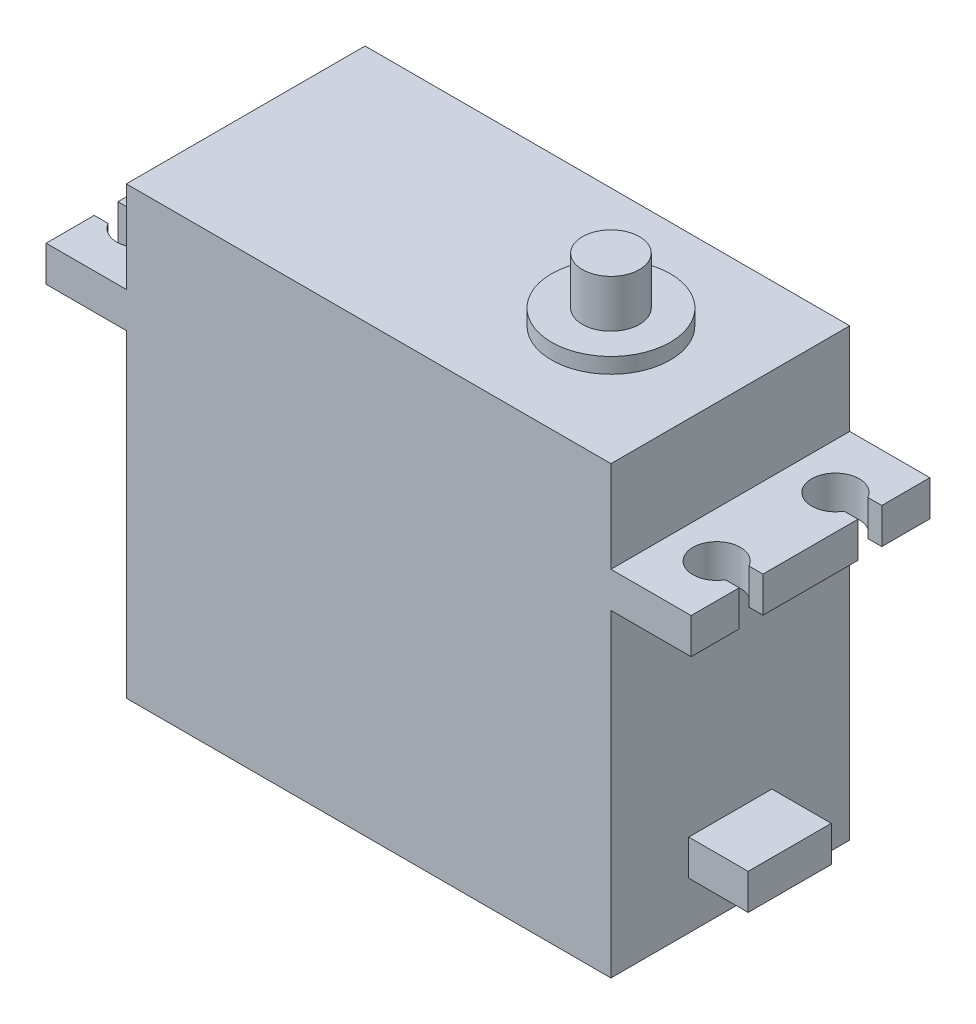
ISO-10303-21;
HEADER;
FILE_DESCRIPTION(('STEP AP214'),'2;1');
FILE_NAME('part.step','',(''),(''),'','','');
FILE_SCHEMA(('AUTOMOTIVE_DESIGN { 1 0 10303 214 1 1 1 1 }'));
ENDSEC;
DATA;
#1=APPLICATION_CONTEXT('core data for automotive mechanical design processes');
#2=APPLICATION_PROTOCOL_DEFINITION('international standard','automotive_design',2000,#1);
#3=PRODUCT_CONTEXT('',#1,'mechanical');
#4=PRODUCT('Part','Part','',(#3));
#5=PRODUCT_RELATED_PRODUCT_CATEGORY('part','',(#4));
#6=PRODUCT_DEFINITION_FORMATION('','',#4);
#7=PRODUCT_DEFINITION_CONTEXT('part definition',#1,'design');
#8=PRODUCT_DEFINITION('design','',#6,#7);
#9=PRODUCT_DEFINITION_SHAPE('','',#8);
#10=(LENGTH_UNIT() NAMED_UNIT(*) SI_UNIT(.MILLI.,.METRE.));
#11=(NAMED_UNIT(*) PLANE_ANGLE_UNIT() SI_UNIT($,.RADIAN.));
#12=(NAMED_UNIT(*) SI_UNIT($,.STERADIAN.) SOLID_ANGLE_UNIT());
#13=UNCERTAINTY_MEASURE_WITH_UNIT(LENGTH_MEASURE(1.E-05),#10,'distance_accuracy_value','');
#14=(GEOMETRIC_REPRESENTATION_CONTEXT(3) GLOBAL_UNCERTAINTY_ASSIGNED_CONTEXT((#13)) GLOBAL_UNIT_ASSIGNED_CONTEXT((#10,
#11,#12)) REPRESENTATION_CONTEXT('',''));
#15=CARTESIAN_POINT('',(0.,0.,0.));
#16=DIRECTION('',(0.,0.,1.));
#17=DIRECTION('',(1.,0.,0.));
#18=AXIS2_PLACEMENT_3D('',#15,#16,#17);
#19=CARTESIAN_POINT('',(10.05,26.8,10.05));
#20=DIRECTION('',(-1.,0.,0.));
#21=DIRECTION('',(0.,-1.,0.));
#22=AXIS2_PLACEMENT_3D('',#19,#20,#21);
#23=PLANE('',#22);
#24=DIRECTION('',(0.,1.,0.));
#25=VECTOR('',#24,1.);
#26=CARTESIAN_POINT('',(10.05,26.8,-10.05));
#27=LINE('',#26,#25);
#28=CARTESIAN_POINT('',(10.05,0.,-10.05));
#29=VERTEX_POINT('',#28);
#30=CARTESIAN_POINT('',(10.05,26.8,-10.05));
#31=VERTEX_POINT('',#30);
#32=EDGE_CURVE('E392',#29,#31,#27,.T.);
#33=ORIENTED_EDGE('',*,*,#32,.T.);
#34=DIRECTION('',(0.,0.,-1.));
#35=VECTOR('',#34,1.);
#36=CARTESIAN_POINT('',(10.05,26.8,10.05));
#37=LINE('',#36,#35);
#38=CARTESIAN_POINT('',(10.05,26.8,10.05));
#39=VERTEX_POINT('',#38);
#40=EDGE_CURVE('E453',#39,#31,#37,.T.);
#41=ORIENTED_EDGE('',*,*,#40,.F.);
#42=DIRECTION('',(0.,1.,0.));
#43=VECTOR('',#42,1.);
#44=CARTESIAN_POINT('',(10.05,26.8,10.05));
#45=LINE('',#44,#43);
#46=CARTESIAN_POINT('',(10.05,0.,10.05));
#47=VERTEX_POINT('',#46);
#48=EDGE_CURVE('E366',#47,#39,#45,.T.);
#49=ORIENTED_EDGE('',*,*,#48,.F.);
#50=DIRECTION('',(0.,0.,-1.));
#51=VECTOR('',#50,1.);
#52=CARTESIAN_POINT('',(10.05,0.,10.05));
#53=LINE('',#52,#51);
#54=EDGE_CURVE('E457',#47,#29,#53,.T.);
#55=ORIENTED_EDGE('',*,*,#54,.T.);
#56=EDGE_LOOP('',(#33,#41,#49,#55));
#57=FACE_BOUND('',#56,.T.);
#58=DIRECTION('',(0.,-1.,0.));
#59=VECTOR('',#58,1.);
#60=CARTESIAN_POINT('',(10.05,7.,3.5));
#61=LINE('',#60,#59);
#62=CARTESIAN_POINT('',(10.05,7.,3.5));
#63=VERTEX_POINT('',#62);
#64=CARTESIAN_POINT('',(10.05,4.,3.5));
#65=VERTEX_POINT('',#64);
#66=EDGE_CURVE('E261',#63,#65,#61,.T.);
#67=ORIENTED_EDGE('',*,*,#66,.F.);
#68=DIRECTION('',(0.,0.,1.));
#69=VECTOR('',#68,1.);
#70=CARTESIAN_POINT('',(10.05,7.,3.5));
#71=LINE('',#70,#69);
#72=CARTESIAN_POINT('',(10.05,7.,-3.5));
#73=VERTEX_POINT('',#72);
#74=EDGE_CURVE('E258',#73,#63,#71,.T.);
#75=ORIENTED_EDGE('',*,*,#74,.F.);
#76=DIRECTION('',(0.,1.,0.));
#77=VECTOR('',#76,1.);
#78=CARTESIAN_POINT('',(10.05,7.,-3.5));
#79=LINE('',#78,#77);
#80=CARTESIAN_POINT('',(10.05,4.,-3.5));
#81=VERTEX_POINT('',#80);
#82=EDGE_CURVE('E52',#81,#73,#79,.T.);
#83=ORIENTED_EDGE('',*,*,#82,.F.);
#84=DIRECTION('',(0.,0.,-1.));
#85=VECTOR('',#84,1.);
#86=CARTESIAN_POINT('',(10.05,4.,3.5));
#87=LINE('',#86,#85);
#88=EDGE_CURVE('E47',#65,#81,#87,.T.);
#89=ORIENTED_EDGE('',*,*,#88,.F.);
#90=EDGE_LOOP('',(#67,#75,#83,#89));
#91=FACE_BOUND('',#90,.T.);
#92=ADVANCED_FACE('F32',(#57,#91),#23,.F.);
#93=CARTESIAN_POINT('',(0.,38.8,0.));
#94=DIRECTION('',(0.,1.,0.));
#95=DIRECTION('',(0.,0.,1.));
#96=AXIS2_PLACEMENT_3D('',#93,#94,#95);
#97=PLANE('',#96);
#98=CARTESIAN_POINT('',(0.,38.8,0.));
#99=DIRECTION('',(0.,1.,0.));
#100=DIRECTION('',(0.,0.,1.));
#101=AXIS2_PLACEMENT_3D('',#98,#99,#100);
#102=CIRCLE('',#101,5.);
#103=CARTESIAN_POINT('',(0.,38.8,5.));
#104=VERTEX_POINT('',#103);
#105=EDGE_CURVE('E272',#104,#104,#102,.T.);
#106=ORIENTED_EDGE('',*,*,#105,.T.);
#107=EDGE_LOOP('',(#106));
#108=FACE_BOUND('',#107,.T.);
#109=CARTESIAN_POINT('',(0.,38.8,0.));
#110=DIRECTION('',(0.,1.,0.));
#111=DIRECTION('',(0.,0.,1.));
#112=AXIS2_PLACEMENT_3D('',#109,#110,#111);
#113=CIRCLE('',#112,2.4);
#114=CARTESIAN_POINT('',(0.,38.8,2.4));
#115=VERTEX_POINT('',#114);
#116=EDGE_CURVE('E262',#115,#115,#113,.T.);
#117=ORIENTED_EDGE('',*,*,#116,.F.);
#118=EDGE_LOOP('',(#117));
#119=FACE_BOUND('',#118,.T.);
#120=ADVANCED_FACE('F547',(#108,#119),#97,.T.);
#121=CARTESIAN_POINT('',(-30.75,37.5,10.05));
#122=DIRECTION('',(0.,-1.,0.));
#123=DIRECTION('',(0.,0.,-1.));
#124=AXIS2_PLACEMENT_3D('',#121,#122,#123);
#125=PLANE('',#124);
#126=DIRECTION('',(-1.,0.,0.));
#127=VECTOR('',#126,1.);
#128=CARTESIAN_POINT('',(-30.75,37.5,-10.05));
#129=LINE('',#128,#127);
#130=CARTESIAN_POINT('',(10.05,37.5,-10.05));
#131=VERTEX_POINT('',#130);
#132=CARTESIAN_POINT('',(-30.75,37.5,-10.05));
#133=VERTEX_POINT('',#132);
#134=EDGE_CURVE('E404',#131,#133,#129,.T.);
#135=ORIENTED_EDGE('',*,*,#134,.T.);
#136=DIRECTION('',(0.,0.,-1.));
#137=VECTOR('',#136,1.);
#138=CARTESIAN_POINT('',(-30.75,37.5,10.05));
#139=LINE('',#138,#137);
#140=CARTESIAN_POINT('',(-30.75,37.5,10.05));
#141=VERTEX_POINT('',#140);
#142=EDGE_CURVE('E435',#141,#133,#139,.T.);
#143=ORIENTED_EDGE('',*,*,#142,.F.);
#144=DIRECTION('',(-1.,0.,0.));
#145=VECTOR('',#144,1.);
#146=CARTESIAN_POINT('',(-30.75,37.5,10.05));
#147=LINE('',#146,#145);
#148=CARTESIAN_POINT('',(10.05,37.5,10.05));
#149=VERTEX_POINT('',#148);
#150=EDGE_CURVE('E377',#149,#141,#147,.T.);
#151=ORIENTED_EDGE('',*,*,#150,.F.);
#152=DIRECTION('',(0.,0.,-1.));
#153=VECTOR('',#152,1.);
#154=CARTESIAN_POINT('',(10.05,37.5,10.05));
#155=LINE('',#154,#153);
#156=EDGE_CURVE('E438',#149,#131,#155,.T.);
#157=ORIENTED_EDGE('',*,*,#156,.T.);
#158=EDGE_LOOP('',(#135,#143,#151,#157));
#159=FACE_BOUND('',#158,.T.);
#160=CARTESIAN_POINT('',(0.,37.5,0.));
#161=DIRECTION('',(0.,-1.,0.));
#162=DIRECTION('',(0.,0.,-1.));
#163=AXIS2_PLACEMENT_3D('',#160,#161,#162);
#164=CIRCLE('',#163,5.);
#165=CARTESIAN_POINT('',(0.,37.5,-5.));
#166=VERTEX_POINT('',#165);
#167=EDGE_CURVE('E11',#166,#166,#164,.F.);
#168=ORIENTED_EDGE('',*,*,#167,.F.);
#169=EDGE_LOOP('',(#168));
#170=FACE_BOUND('',#169,.T.);
#171=ADVANCED_FACE('F552',(#159,#170),#125,.F.);
#172=CARTESIAN_POINT('',(16.8,29.8,10.05));
#173=DIRECTION('',(-1.,0.,0.));
#174=DIRECTION('',(0.,0.,1.));
#175=AXIS2_PLACEMENT_3D('',#172,#173,#174);
#176=PLANE('',#175);
#177=DIRECTION('',(0.,0.,-1.));
#178=VECTOR('',#177,1.);
#179=CARTESIAN_POINT('',(16.8,26.8,10.05));
#180=LINE('',#179,#178);
#181=CARTESIAN_POINT('',(16.8,26.8,3.99999999999999));
#182=VERTEX_POINT('',#181);
#183=CARTESIAN_POINT('',(16.8,26.8,-4.));
#184=VERTEX_POINT('',#183);
#185=EDGE_CURVE('E454',#182,#184,#180,.T.);
#186=ORIENTED_EDGE('',*,*,#185,.T.);
#187=DIRECTION('',(0.,1.,0.));
#188=VECTOR('',#187,1.);
#189=CARTESIAN_POINT('',(16.8,0.,-4.));
#190=LINE('',#189,#188);
#191=CARTESIAN_POINT('',(16.8,29.8,-4.));
#192=VERTEX_POINT('',#191);
#193=EDGE_CURVE('E285',#184,#192,#190,.T.);
#194=ORIENTED_EDGE('',*,*,#193,.T.);
#195=DIRECTION('',(0.,0.,-1.));
#196=VECTOR('',#195,1.);
#197=CARTESIAN_POINT('',(16.8,29.8,10.05));
#198=LINE('',#197,#196);
#199=CARTESIAN_POINT('',(16.8,29.8,3.99999999999999));
#200=VERTEX_POINT('',#199);
#201=EDGE_CURVE('E449',#200,#192,#198,.T.);
#202=ORIENTED_EDGE('',*,*,#201,.F.);
#203=DIRECTION('',(0.,1.,0.));
#204=VECTOR('',#203,1.);
#205=CARTESIAN_POINT('',(16.8,0.,3.99999999999999));
#206=LINE('',#205,#204);
#207=EDGE_CURVE('E344',#182,#200,#206,.T.);
#208=ORIENTED_EDGE('',*,*,#207,.F.);
#209=EDGE_LOOP('',(#186,#194,#202,#208));
#210=FACE_BOUND('',#209,.T.);
#211=ADVANCED_FACE('F565',(#210),#176,.F.);
#212=CARTESIAN_POINT('',(-37.5,26.8,10.05));
#213=DIRECTION('',(1.,0.,0.));
#214=DIRECTION('',(0.,0.,-1.));
#215=AXIS2_PLACEMENT_3D('',#212,#213,#214);
#216=PLANE('',#215);
#217=DIRECTION('',(0.,0.,-1.));
#218=VECTOR('',#217,1.);
#219=CARTESIAN_POINT('',(-37.5,29.8,10.05));
#220=LINE('',#219,#218);
#221=CARTESIAN_POINT('',(-37.5,29.8,4.));
#222=VERTEX_POINT('',#221);
#223=CARTESIAN_POINT('',(-37.5,29.8,-3.99999999999999));
#224=VERTEX_POINT('',#223);
#225=EDGE_CURVE('E432',#222,#224,#220,.T.);
#226=ORIENTED_EDGE('',*,*,#225,.T.);
#227=DIRECTION('',(0.,1.,0.));
#228=VECTOR('',#227,1.);
#229=CARTESIAN_POINT('',(-37.5,0.,-3.99999999999999));
#230=LINE('',#229,#228);
#231=CARTESIAN_POINT('',(-37.5,26.8,-3.99999999999999));
#232=VERTEX_POINT('',#231);
#233=EDGE_CURVE('E311',#232,#224,#230,.T.);
#234=ORIENTED_EDGE('',*,*,#233,.F.);
#235=DIRECTION('',(0.,0.,-1.));
#236=VECTOR('',#235,1.);
#237=CARTESIAN_POINT('',(-37.5,26.8,10.05));
#238=LINE('',#237,#236);
#239=CARTESIAN_POINT('',(-37.5,26.8,4.));
#240=VERTEX_POINT('',#239);
#241=EDGE_CURVE('E427',#240,#232,#238,.T.);
#242=ORIENTED_EDGE('',*,*,#241,.F.);
#243=DIRECTION('',(0.,1.,0.));
#244=VECTOR('',#243,1.);
#245=CARTESIAN_POINT('',(-37.5,0.,4.));
#246=LINE('',#245,#244);
#247=EDGE_CURVE('E327',#240,#222,#246,.T.);
#248=ORIENTED_EDGE('',*,*,#247,.T.);
#249=EDGE_LOOP('',(#226,#234,#242,#248));
#250=FACE_BOUND('',#249,.T.);
#251=ADVANCED_FACE('F486',(#250),#216,.F.);
#252=CARTESIAN_POINT('',(-37.5,26.8,-6.));
#253=VERTEX_POINT('',#252);
#254=CARTESIAN_POINT('',(-37.5,26.8,-10.05));
#255=VERTEX_POINT('',#254);
#256=EDGE_CURVE('E422',#253,#255,#238,.T.);
#257=ORIENTED_EDGE('',*,*,#256,.F.);
#258=DIRECTION('',(0.,1.,0.));
#259=VECTOR('',#258,1.);
#260=CARTESIAN_POINT('',(-37.5,0.,-6.));
#261=LINE('',#260,#259);
#262=CARTESIAN_POINT('',(-37.5,29.8,-6.));
#263=VERTEX_POINT('',#262);
#264=EDGE_CURVE('E314',#253,#263,#261,.T.);
#265=ORIENTED_EDGE('',*,*,#264,.T.);
#266=CARTESIAN_POINT('',(-37.5,29.8,-10.05));
#267=VERTEX_POINT('',#266);
#268=EDGE_CURVE('E426',#263,#267,#220,.T.);
#269=ORIENTED_EDGE('',*,*,#268,.T.);
#270=DIRECTION('',(0.,-1.,0.));
#271=VECTOR('',#270,1.);
#272=CARTESIAN_POINT('',(-37.5,26.8,-10.05));
#273=LINE('',#272,#271);
#274=EDGE_CURVE('E411',#267,#255,#273,.T.);
#275=ORIENTED_EDGE('',*,*,#274,.T.);
#276=EDGE_LOOP('',(#257,#265,#269,#275));
#277=FACE_BOUND('',#276,.T.);
#278=ADVANCED_FACE('F493',(#277),#216,.F.);
#279=CARTESIAN_POINT('',(16.8,26.8,10.05));
#280=VERTEX_POINT('',#279);
#281=CARTESIAN_POINT('',(16.8,26.8,6.));
#282=VERTEX_POINT('',#281);
#283=EDGE_CURVE('E450',#280,#282,#180,.T.);
#284=ORIENTED_EDGE('',*,*,#283,.T.);
#285=DIRECTION('',(0.,1.,0.));
#286=VECTOR('',#285,1.);
#287=CARTESIAN_POINT('',(16.8,0.,6.));
#288=LINE('',#287,#286);
#289=CARTESIAN_POINT('',(16.8,29.8,6.));
#290=VERTEX_POINT('',#289);
#291=EDGE_CURVE('E345',#282,#290,#288,.T.);
#292=ORIENTED_EDGE('',*,*,#291,.T.);
#293=CARTESIAN_POINT('',(16.8,29.8,10.05));
#294=VERTEX_POINT('',#293);
#295=EDGE_CURVE('E445',#294,#290,#198,.T.);
#296=ORIENTED_EDGE('',*,*,#295,.F.);
#297=DIRECTION('',(0.,1.,0.));
#298=VECTOR('',#297,1.);
#299=CARTESIAN_POINT('',(16.8,29.8,10.05));
#300=LINE('',#299,#298);
#301=EDGE_CURVE('E371',#280,#294,#300,.T.);
#302=ORIENTED_EDGE('',*,*,#301,.F.);
#303=EDGE_LOOP('',(#284,#292,#296,#302));
#304=FACE_BOUND('',#303,.T.);
#305=ADVANCED_FACE('F566',(#304),#176,.F.);
#306=CARTESIAN_POINT('',(10.05,0.,10.05));
#307=DIRECTION('',(0.,1.,0.));
#308=DIRECTION('',(0.,0.,1.));
#309=AXIS2_PLACEMENT_3D('',#306,#307,#308);
#310=PLANE('',#309);
#311=DIRECTION('',(1.,0.,0.));
#312=VECTOR('',#311,1.);
#313=CARTESIAN_POINT('',(10.05,0.,-10.05));
#314=LINE('',#313,#312);
#315=CARTESIAN_POINT('',(-30.75,0.,-10.05));
#316=VERTEX_POINT('',#315);
#317=EDGE_CURVE('E362',#316,#29,#314,.T.);
#318=ORIENTED_EDGE('',*,*,#317,.T.);
#319=ORIENTED_EDGE('',*,*,#54,.F.);
#320=DIRECTION('',(1.,0.,0.));
#321=VECTOR('',#320,1.);
#322=CARTESIAN_POINT('',(10.05,0.,10.05));
#323=LINE('',#322,#321);
#324=CARTESIAN_POINT('',(-30.75,0.,10.05));
#325=VERTEX_POINT('',#324);
#326=EDGE_CURVE('E363',#325,#47,#323,.T.);
#327=ORIENTED_EDGE('',*,*,#326,.F.);
#328=DIRECTION('',(0.,0.,-1.));
#329=VECTOR('',#328,1.);
#330=CARTESIAN_POINT('',(-30.75,0.,10.05));
#331=LINE('',#330,#329);
#332=EDGE_CURVE('E389',#325,#316,#331,.T.);
#333=ORIENTED_EDGE('',*,*,#332,.T.);
#334=EDGE_LOOP('',(#318,#319,#327,#333));
#335=FACE_BOUND('',#334,.T.);
#336=ADVANCED_FACE('F34',(#335),#310,.F.);
#337=CARTESIAN_POINT('',(16.8,26.8,10.05));
#338=DIRECTION('',(0.,1.,0.));
#339=DIRECTION('',(-1.,0.,0.));
#340=AXIS2_PLACEMENT_3D('',#337,#338,#339);
#341=PLANE('',#340);
#342=CARTESIAN_POINT('',(13.9,26.8,-5.));
#343=DIRECTION('',(0.,1.,0.));
#344=DIRECTION('',(-1.,0.,0.));
#345=AXIS2_PLACEMENT_3D('',#342,#343,#344);
#346=CIRCLE('',#345,2.00000000000002);
#347=CARTESIAN_POINT('',(15.6320508075689,26.8,-6.));
#348=VERTEX_POINT('',#347);
#349=CARTESIAN_POINT('',(15.6320508075689,26.8,-4.));
#350=VERTEX_POINT('',#349);
#351=EDGE_CURVE('E296',#348,#350,#346,.T.);
#352=ORIENTED_EDGE('',*,*,#351,.T.);
#353=DIRECTION('',(1.,0.,0.));
#354=VECTOR('',#353,1.);
#355=CARTESIAN_POINT('',(16.8,26.8,-4.));
#356=LINE('',#355,#354);
#357=EDGE_CURVE('E299',#350,#184,#356,.T.);
#358=ORIENTED_EDGE('',*,*,#357,.T.);
#359=ORIENTED_EDGE('',*,*,#185,.F.);
#360=DIRECTION('',(-1.,0.,0.));
#361=VECTOR('',#360,1.);
#362=CARTESIAN_POINT('',(16.8,26.8,3.99999999999999));
#363=LINE('',#362,#361);
#364=CARTESIAN_POINT('',(15.6320508075689,26.8,4.));
#365=VERTEX_POINT('',#364);
#366=EDGE_CURVE('E348',#182,#365,#363,.T.);
#367=ORIENTED_EDGE('',*,*,#366,.T.);
#368=CARTESIAN_POINT('',(13.9,26.8,5.));
#369=DIRECTION('',(0.,1.,0.));
#370=DIRECTION('',(-1.,0.,0.));
#371=AXIS2_PLACEMENT_3D('',#368,#369,#370);
#372=CIRCLE('',#371,2.00000000000002);
#373=CARTESIAN_POINT('',(15.6320508075689,26.8,6.));
#374=VERTEX_POINT('',#373);
#375=EDGE_CURVE('E356',#365,#374,#372,.T.);
#376=ORIENTED_EDGE('',*,*,#375,.T.);
#377=DIRECTION('',(1.,0.,0.));
#378=VECTOR('',#377,1.);
#379=CARTESIAN_POINT('',(16.8,26.8,6.));
#380=LINE('',#379,#378);
#381=EDGE_CURVE('E359',#374,#282,#380,.T.);
#382=ORIENTED_EDGE('',*,*,#381,.T.);
#383=ORIENTED_EDGE('',*,*,#283,.F.);
#384=DIRECTION('',(1.,0.,0.));
#385=VECTOR('',#384,1.);
#386=CARTESIAN_POINT('',(16.8,26.8,10.05));
#387=LINE('',#386,#385);
#388=EDGE_CURVE('E369',#39,#280,#387,.T.);
#389=ORIENTED_EDGE('',*,*,#388,.F.);
#390=ORIENTED_EDGE('',*,*,#40,.T.);
#391=DIRECTION('',(1.,0.,0.));
#392=VECTOR('',#391,1.);
#393=CARTESIAN_POINT('',(16.8,26.8,-10.05));
#394=LINE('',#393,#392);
#395=CARTESIAN_POINT('',(16.8,26.8,-10.05));
#396=VERTEX_POINT('',#395);
#397=EDGE_CURVE('E394',#31,#396,#394,.T.);
#398=ORIENTED_EDGE('',*,*,#397,.T.);
#399=CARTESIAN_POINT('',(16.8,26.8,-6.));
#400=VERTEX_POINT('',#399);
#401=EDGE_CURVE('E448',#400,#396,#180,.T.);
#402=ORIENTED_EDGE('',*,*,#401,.F.);
#403=DIRECTION('',(-1.,0.,0.));
#404=VECTOR('',#403,1.);
#405=CARTESIAN_POINT('',(16.8,26.8,-6.));
#406=LINE('',#405,#404);
#407=EDGE_CURVE('E288',#400,#348,#406,.T.);
#408=ORIENTED_EDGE('',*,*,#407,.T.);
#409=EDGE_LOOP('',(#352,#358,#359,#367,#376,#382,#383,#389,#390,#398,#402,#408));
#410=FACE_BOUND('',#409,.T.);
#411=ADVANCED_FACE('F556',(#410),#341,.F.);
#412=CARTESIAN_POINT('',(16.8,29.8,-6.));
#413=VERTEX_POINT('',#412);
#414=CARTESIAN_POINT('',(16.8,29.8,-10.05));
#415=VERTEX_POINT('',#414);
#416=EDGE_CURVE('E444',#413,#415,#198,.T.);
#417=ORIENTED_EDGE('',*,*,#416,.F.);
#418=DIRECTION('',(0.,1.,0.));
#419=VECTOR('',#418,1.);
#420=CARTESIAN_POINT('',(16.8,0.,-6.));
#421=LINE('',#420,#419);
#422=EDGE_CURVE('E284',#400,#413,#421,.T.);
#423=ORIENTED_EDGE('',*,*,#422,.F.);
#424=ORIENTED_EDGE('',*,*,#401,.T.);
#425=DIRECTION('',(0.,1.,0.));
#426=VECTOR('',#425,1.);
#427=CARTESIAN_POINT('',(16.8,29.8,-10.05));
#428=LINE('',#427,#426);
#429=EDGE_CURVE('E397',#396,#415,#428,.T.);
#430=ORIENTED_EDGE('',*,*,#429,.T.);
#431=EDGE_LOOP('',(#417,#423,#424,#430));
#432=FACE_BOUND('',#431,.T.);
#433=ADVANCED_FACE('F559',(#432),#176,.F.);
#434=CARTESIAN_POINT('',(10.05,29.8,10.05));
#435=DIRECTION('',(0.,-1.,0.));
#436=DIRECTION('',(1.,0.,0.));
#437=AXIS2_PLACEMENT_3D('',#434,#435,#436);
#438=PLANE('',#437);
#439=ORIENTED_EDGE('',*,*,#201,.T.);
#440=DIRECTION('',(1.,0.,0.));
#441=VECTOR('',#440,1.);
#442=CARTESIAN_POINT('',(16.8,29.8,-4.));
#443=LINE('',#442,#441);
#444=CARTESIAN_POINT('',(15.6320508075689,29.8,-4.));
#445=VERTEX_POINT('',#444);
#446=EDGE_CURVE('E282',#445,#192,#443,.T.);
#447=ORIENTED_EDGE('',*,*,#446,.F.);
#448=CARTESIAN_POINT('',(13.9,29.8,-5.));
#449=DIRECTION('',(0.,1.,0.));
#450=DIRECTION('',(0.,0.,1.));
#451=AXIS2_PLACEMENT_3D('',#448,#449,#450);
#452=CIRCLE('',#451,2.00000000000002);
#453=CARTESIAN_POINT('',(15.6320508075689,29.8,-6.));
#454=VERTEX_POINT('',#453);
#455=EDGE_CURVE('E279',#454,#445,#452,.T.);
#456=ORIENTED_EDGE('',*,*,#455,.F.);
#457=DIRECTION('',(-1.,0.,0.));
#458=VECTOR('',#457,1.);
#459=CARTESIAN_POINT('',(16.8,29.8,-6.));
#460=LINE('',#459,#458);
#461=EDGE_CURVE('E276',#413,#454,#460,.T.);
#462=ORIENTED_EDGE('',*,*,#461,.F.);
#463=ORIENTED_EDGE('',*,*,#416,.T.);
#464=DIRECTION('',(-1.,0.,0.));
#465=VECTOR('',#464,1.);
#466=CARTESIAN_POINT('',(10.05,29.8,-10.05));
#467=LINE('',#466,#465);
#468=CARTESIAN_POINT('',(10.05,29.8,-10.05));
#469=VERTEX_POINT('',#468);
#470=EDGE_CURVE('E400',#415,#469,#467,.T.);
#471=ORIENTED_EDGE('',*,*,#470,.T.);
#472=DIRECTION('',(0.,0.,-1.));
#473=VECTOR('',#472,1.);
#474=CARTESIAN_POINT('',(10.05,29.8,10.05));
#475=LINE('',#474,#473);
#476=CARTESIAN_POINT('',(10.05,29.8,10.05));
#477=VERTEX_POINT('',#476);
#478=EDGE_CURVE('E441',#477,#469,#475,.T.);
#479=ORIENTED_EDGE('',*,*,#478,.F.);
#480=DIRECTION('',(-1.,0.,0.));
#481=VECTOR('',#480,1.);
#482=CARTESIAN_POINT('',(10.05,29.8,10.05));
#483=LINE('',#482,#481);
#484=EDGE_CURVE('E373',#294,#477,#483,.T.);
#485=ORIENTED_EDGE('',*,*,#484,.F.);
#486=ORIENTED_EDGE('',*,*,#295,.T.);
#487=DIRECTION('',(1.,0.,0.));
#488=VECTOR('',#487,1.);
#489=CARTESIAN_POINT('',(16.8,29.8,6.));
#490=LINE('',#489,#488);
#491=CARTESIAN_POINT('',(15.6320508075689,29.8,6.));
#492=VERTEX_POINT('',#491);
#493=EDGE_CURVE('E342',#492,#290,#490,.T.);
#494=ORIENTED_EDGE('',*,*,#493,.F.);
#495=CARTESIAN_POINT('',(13.9,29.8,5.));
#496=DIRECTION('',(0.,1.,0.));
#497=DIRECTION('',(0.,0.,1.));
#498=AXIS2_PLACEMENT_3D('',#495,#496,#497);
#499=CIRCLE('',#498,2.00000000000002);
#500=CARTESIAN_POINT('',(15.6320508075689,29.8,4.));
#501=VERTEX_POINT('',#500);
#502=EDGE_CURVE('E339',#501,#492,#499,.T.);
#503=ORIENTED_EDGE('',*,*,#502,.F.);
#504=DIRECTION('',(-1.,0.,0.));
#505=VECTOR('',#504,1.);
#506=CARTESIAN_POINT('',(16.8,29.8,3.99999999999999));
#507=LINE('',#506,#505);
#508=EDGE_CURVE('E330',#200,#501,#507,.T.);
#509=ORIENTED_EDGE('',*,*,#508,.F.);
#510=EDGE_LOOP('',(#439,#447,#456,#462,#463,#471,#479,#485,#486,#494,#503,#509));
#511=FACE_BOUND('',#510,.T.);
#512=ADVANCED_FACE('F563',(#511),#438,.F.);
#513=CARTESIAN_POINT('',(10.05,37.5,10.05));
#514=DIRECTION('',(-1.,0.,0.));
#515=DIRECTION('',(0.,0.,1.));
#516=AXIS2_PLACEMENT_3D('',#513,#514,#515);
#517=PLANE('',#516);
#518=DIRECTION('',(0.,1.,0.));
#519=VECTOR('',#518,1.);
#520=CARTESIAN_POINT('',(10.05,37.5,-10.05));
#521=LINE('',#520,#519);
#522=EDGE_CURVE('E402',#469,#131,#521,.T.);
#523=ORIENTED_EDGE('',*,*,#522,.T.);
#524=ORIENTED_EDGE('',*,*,#156,.F.);
#525=DIRECTION('',(0.,1.,0.));
#526=VECTOR('',#525,1.);
#527=CARTESIAN_POINT('',(10.05,37.5,10.05));
#528=LINE('',#527,#526);
#529=EDGE_CURVE('E375',#477,#149,#528,.T.);
#530=ORIENTED_EDGE('',*,*,#529,.F.);
#531=ORIENTED_EDGE('',*,*,#478,.T.);
#532=EDGE_LOOP('',(#523,#524,#530,#531));
#533=FACE_BOUND('',#532,.T.);
#534=ADVANCED_FACE('F569',(#533),#517,.F.);
#535=CARTESIAN_POINT('',(-30.75,29.8,10.05));
#536=DIRECTION('',(1.,0.,0.));
#537=DIRECTION('',(0.,0.,-1.));
#538=AXIS2_PLACEMENT_3D('',#535,#536,#537);
#539=PLANE('',#538);
#540=DIRECTION('',(0.,-1.,0.));
#541=VECTOR('',#540,1.);
#542=CARTESIAN_POINT('',(-30.75,29.8,-10.05));
#543=LINE('',#542,#541);
#544=CARTESIAN_POINT('',(-30.75,29.8,-10.05));
#545=VERTEX_POINT('',#544);
#546=EDGE_CURVE('E406',#133,#545,#543,.T.);
#547=ORIENTED_EDGE('',*,*,#546,.T.);
#548=DIRECTION('',(0.,0.,-1.));
#549=VECTOR('',#548,1.);
#550=CARTESIAN_POINT('',(-30.75,29.8,10.05));
#551=LINE('',#550,#549);
#552=CARTESIAN_POINT('',(-30.75,29.8,10.05));
#553=VERTEX_POINT('',#552);
#554=EDGE_CURVE('E431',#553,#545,#551,.T.);
#555=ORIENTED_EDGE('',*,*,#554,.F.);
#556=DIRECTION('',(0.,-1.,0.));
#557=VECTOR('',#556,1.);
#558=CARTESIAN_POINT('',(-30.75,29.8,10.05));
#559=LINE('',#558,#557);
#560=EDGE_CURVE('E379',#141,#553,#559,.T.);
#561=ORIENTED_EDGE('',*,*,#560,.F.);
#562=ORIENTED_EDGE('',*,*,#142,.T.);
#563=EDGE_LOOP('',(#547,#555,#561,#562));
#564=FACE_BOUND('',#563,.T.);
#565=ADVANCED_FACE('F573',(#564),#539,.F.);
#566=CARTESIAN_POINT('',(-37.5,29.8,10.05));
#567=DIRECTION('',(0.,-1.,0.));
#568=DIRECTION('',(1.,0.,0.));
#569=AXIS2_PLACEMENT_3D('',#566,#567,#568);
#570=PLANE('',#569);
#571=CARTESIAN_POINT('',(-34.6,29.8,-5.));
#572=DIRECTION('',(0.,1.,0.));
#573=DIRECTION('',(0.,0.,1.));
#574=AXIS2_PLACEMENT_3D('',#571,#572,#573);
#575=CIRCLE('',#574,2.);
#576=CARTESIAN_POINT('',(-36.3320508075689,29.8,-3.99999999999999));
#577=VERTEX_POINT('',#576);
#578=CARTESIAN_POINT('',(-36.3320508075689,29.8,-6.));
#579=VERTEX_POINT('',#578);
#580=EDGE_CURVE('E305',#577,#579,#575,.T.);
#581=ORIENTED_EDGE('',*,*,#580,.F.);
#582=DIRECTION('',(1.,0.,0.));
#583=VECTOR('',#582,1.);
#584=CARTESIAN_POINT('',(-37.5,29.8,-3.99999999999999));
#585=LINE('',#584,#583);
#586=EDGE_CURVE('E302',#224,#577,#585,.T.);
#587=ORIENTED_EDGE('',*,*,#586,.F.);
#588=ORIENTED_EDGE('',*,*,#225,.F.);
#589=DIRECTION('',(-1.,0.,0.));
#590=VECTOR('',#589,1.);
#591=CARTESIAN_POINT('',(-37.5,29.8,4.));
#592=LINE('',#591,#590);
#593=CARTESIAN_POINT('',(-36.3320508075689,29.8,4.));
#594=VERTEX_POINT('',#593);
#595=EDGE_CURVE('E313',#594,#222,#592,.T.);
#596=ORIENTED_EDGE('',*,*,#595,.F.);
#597=CARTESIAN_POINT('',(-34.6,29.8,5.));
#598=DIRECTION('',(0.,1.,0.));
#599=DIRECTION('',(0.,0.,1.));
#600=AXIS2_PLACEMENT_3D('',#597,#598,#599);
#601=CIRCLE('',#600,2.);
#602=CARTESIAN_POINT('',(-36.3320508075689,29.8,6.));
#603=VERTEX_POINT('',#602);
#604=EDGE_CURVE('E324',#603,#594,#601,.T.);
#605=ORIENTED_EDGE('',*,*,#604,.F.);
#606=DIRECTION('',(1.,0.,0.));
#607=VECTOR('',#606,1.);
#608=CARTESIAN_POINT('',(-37.5,29.8,6.));
#609=LINE('',#608,#607);
#610=CARTESIAN_POINT('',(-37.5,29.8,6.));
#611=VERTEX_POINT('',#610);
#612=EDGE_CURVE('E321',#611,#603,#609,.T.);
#613=ORIENTED_EDGE('',*,*,#612,.F.);
#614=CARTESIAN_POINT('',(-37.5,29.8,10.05));
#615=VERTEX_POINT('',#614);
#616=EDGE_CURVE('E428',#615,#611,#220,.T.);
#617=ORIENTED_EDGE('',*,*,#616,.F.);
#618=DIRECTION('',(-1.,0.,0.));
#619=VECTOR('',#618,1.);
#620=CARTESIAN_POINT('',(-37.5,29.8,10.05));
#621=LINE('',#620,#619);
#622=EDGE_CURVE('E381',#553,#615,#621,.T.);
#623=ORIENTED_EDGE('',*,*,#622,.F.);
#624=ORIENTED_EDGE('',*,*,#554,.T.);
#625=DIRECTION('',(-1.,0.,0.));
#626=VECTOR('',#625,1.);
#627=CARTESIAN_POINT('',(-37.5,29.8,-10.05));
#628=LINE('',#627,#626);
#629=EDGE_CURVE('E408',#545,#267,#628,.T.);
#630=ORIENTED_EDGE('',*,*,#629,.T.);
#631=ORIENTED_EDGE('',*,*,#268,.F.);
#632=DIRECTION('',(-1.,0.,0.));
#633=VECTOR('',#632,1.);
#634=CARTESIAN_POINT('',(-37.5,29.8,-6.));
#635=LINE('',#634,#633);
#636=EDGE_CURVE('E308',#579,#263,#635,.T.);
#637=ORIENTED_EDGE('',*,*,#636,.F.);
#638=EDGE_LOOP('',(#581,#587,#588,#596,#605,#613,#617,#623,#624,#630,#631,#637));
#639=FACE_BOUND('',#638,.T.);
#640=ADVANCED_FACE('F499',(#639),#570,.F.);
#641=ORIENTED_EDGE('',*,*,#616,.T.);
#642=DIRECTION('',(0.,1.,0.));
#643=VECTOR('',#642,1.);
#644=CARTESIAN_POINT('',(-37.5,0.,6.));
#645=LINE('',#644,#643);
#646=CARTESIAN_POINT('',(-37.5,26.8,6.));
#647=VERTEX_POINT('',#646);
#648=EDGE_CURVE('E333',#647,#611,#645,.T.);
#649=ORIENTED_EDGE('',*,*,#648,.F.);
#650=CARTESIAN_POINT('',(-37.5,26.8,10.05));
#651=VERTEX_POINT('',#650);
#652=EDGE_CURVE('E423',#651,#647,#238,.T.);
#653=ORIENTED_EDGE('',*,*,#652,.F.);
#654=DIRECTION('',(0.,-1.,0.));
#655=VECTOR('',#654,1.);
#656=CARTESIAN_POINT('',(-37.5,26.8,10.05));
#657=LINE('',#656,#655);
#658=EDGE_CURVE('E383',#615,#651,#657,.T.);
#659=ORIENTED_EDGE('',*,*,#658,.F.);
#660=EDGE_LOOP('',(#641,#649,#653,#659));
#661=FACE_BOUND('',#660,.T.);
#662=ADVANCED_FACE('F521',(#661),#216,.F.);
#663=CARTESIAN_POINT('',(-30.75,26.8,10.05));
#664=DIRECTION('',(0.,1.,0.));
#665=DIRECTION('',(-1.,0.,0.));
#666=AXIS2_PLACEMENT_3D('',#663,#664,#665);
#667=PLANE('',#666);
#668=ORIENTED_EDGE('',*,*,#241,.T.);
#669=DIRECTION('',(1.,0.,0.));
#670=VECTOR('',#669,1.);
#671=CARTESIAN_POINT('',(-30.75,26.8,-3.99999999999999));
#672=LINE('',#671,#670);
#673=CARTESIAN_POINT('',(-36.3320508075689,26.8,-3.99999999999999));
#674=VERTEX_POINT('',#673);
#675=EDGE_CURVE('E40',#232,#674,#672,.T.);
#676=ORIENTED_EDGE('',*,*,#675,.T.);
#677=CARTESIAN_POINT('',(-34.6,26.8,-5.));
#678=DIRECTION('',(0.,1.,0.));
#679=DIRECTION('',(-1.,0.,0.));
#680=AXIS2_PLACEMENT_3D('',#677,#678,#679);
#681=CIRCLE('',#680,2.);
#682=CARTESIAN_POINT('',(-36.3320508075689,26.8,-6.));
#683=VERTEX_POINT('',#682);
#684=EDGE_CURVE('E469',#674,#683,#681,.T.);
#685=ORIENTED_EDGE('',*,*,#684,.T.);
#686=DIRECTION('',(-1.,0.,0.));
#687=VECTOR('',#686,1.);
#688=CARTESIAN_POINT('',(-30.75,26.8,-6.));
#689=LINE('',#688,#687);
#690=EDGE_CURVE('E472',#683,#253,#689,.T.);
#691=ORIENTED_EDGE('',*,*,#690,.T.);
#692=ORIENTED_EDGE('',*,*,#256,.T.);
#693=DIRECTION('',(1.,0.,0.));
#694=VECTOR('',#693,1.);
#695=CARTESIAN_POINT('',(-30.75,26.8,-10.05));
#696=LINE('',#695,#694);
#697=CARTESIAN_POINT('',(-30.75,26.8,-10.05));
#698=VERTEX_POINT('',#697);
#699=EDGE_CURVE('E414',#255,#698,#696,.T.);
#700=ORIENTED_EDGE('',*,*,#699,.T.);
#701=DIRECTION('',(0.,0.,-1.));
#702=VECTOR('',#701,1.);
#703=CARTESIAN_POINT('',(-30.75,26.8,10.05));
#704=LINE('',#703,#702);
#705=CARTESIAN_POINT('',(-30.75,26.8,10.05));
#706=VERTEX_POINT('',#705);
#707=EDGE_CURVE('E419',#706,#698,#704,.T.);
#708=ORIENTED_EDGE('',*,*,#707,.F.);
#709=DIRECTION('',(1.,0.,0.));
#710=VECTOR('',#709,1.);
#711=CARTESIAN_POINT('',(-30.75,26.8,10.05));
#712=LINE('',#711,#710);
#713=EDGE_CURVE('E385',#651,#706,#712,.T.);
#714=ORIENTED_EDGE('',*,*,#713,.F.);
#715=ORIENTED_EDGE('',*,*,#652,.T.);
#716=DIRECTION('',(1.,0.,0.));
#717=VECTOR('',#716,1.);
#718=CARTESIAN_POINT('',(-30.75,26.8,6.00000000000001));
#719=LINE('',#718,#717);
#720=CARTESIAN_POINT('',(-36.3320508075689,26.8,6.));
#721=VERTEX_POINT('',#720);
#722=EDGE_CURVE('E460',#647,#721,#719,.T.);
#723=ORIENTED_EDGE('',*,*,#722,.T.);
#724=CARTESIAN_POINT('',(-34.6,26.8,5.));
#725=DIRECTION('',(0.,1.,0.));
#726=DIRECTION('',(-1.,0.,0.));
#727=AXIS2_PLACEMENT_3D('',#724,#725,#726);
#728=CIRCLE('',#727,2.);
#729=CARTESIAN_POINT('',(-36.3320508075689,26.8,4.));
#730=VERTEX_POINT('',#729);
#731=EDGE_CURVE('E463',#721,#730,#728,.T.);
#732=ORIENTED_EDGE('',*,*,#731,.T.);
#733=DIRECTION('',(-1.,0.,0.));
#734=VECTOR('',#733,1.);
#735=CARTESIAN_POINT('',(-30.75,26.8,4.));
#736=LINE('',#735,#734);
#737=EDGE_CURVE('E466',#730,#240,#736,.T.);
#738=ORIENTED_EDGE('',*,*,#737,.T.);
#739=EDGE_LOOP('',(#668,#676,#685,#691,#692,#700,#708,#714,#715,#723,#732,#738));
#740=FACE_BOUND('',#739,.T.);
#741=ADVANCED_FACE('F477',(#740),#667,.F.);
#742=CARTESIAN_POINT('',(-30.75,0.,10.05));
#743=DIRECTION('',(1.,0.,0.));
#744=DIRECTION('',(0.,0.,-1.));
#745=AXIS2_PLACEMENT_3D('',#742,#743,#744);
#746=PLANE('',#745);
#747=DIRECTION('',(0.,-1.,0.));
#748=VECTOR('',#747,1.);
#749=CARTESIAN_POINT('',(-30.75,0.,-10.05));
#750=LINE('',#749,#748);
#751=EDGE_CURVE('E367',#698,#316,#750,.T.);
#752=ORIENTED_EDGE('',*,*,#751,.T.);
#753=ORIENTED_EDGE('',*,*,#332,.F.);
#754=DIRECTION('',(0.,-1.,0.));
#755=VECTOR('',#754,1.);
#756=CARTESIAN_POINT('',(-30.75,0.,10.05));
#757=LINE('',#756,#755);
#758=EDGE_CURVE('E387',#706,#325,#757,.T.);
#759=ORIENTED_EDGE('',*,*,#758,.F.);
#760=ORIENTED_EDGE('',*,*,#707,.T.);
#761=EDGE_LOOP('',(#752,#753,#759,#760));
#762=FACE_BOUND('',#761,.T.);
#763=ADVANCED_FACE('F511',(#762),#746,.F.);
#764=CARTESIAN_POINT('',(0.,0.,10.05));
#765=DIRECTION('',(0.,0.,-1.));
#766=DIRECTION('',(-1.,0.,0.));
#767=AXIS2_PLACEMENT_3D('',#764,#765,#766);
#768=PLANE('',#767);
#769=ORIENTED_EDGE('',*,*,#326,.T.);
#770=ORIENTED_EDGE('',*,*,#48,.T.);
#771=ORIENTED_EDGE('',*,*,#388,.T.);
#772=ORIENTED_EDGE('',*,*,#301,.T.);
#773=ORIENTED_EDGE('',*,*,#484,.T.);
#774=ORIENTED_EDGE('',*,*,#529,.T.);
#775=ORIENTED_EDGE('',*,*,#150,.T.);
#776=ORIENTED_EDGE('',*,*,#560,.T.);
#777=ORIENTED_EDGE('',*,*,#622,.T.);
#778=ORIENTED_EDGE('',*,*,#658,.T.);
#779=ORIENTED_EDGE('',*,*,#713,.T.);
#780=ORIENTED_EDGE('',*,*,#758,.T.);
#781=EDGE_LOOP('',(#769,#770,#771,#772,#773,#774,#775,#776,#777,#778,#779,#780));
#782=FACE_BOUND('',#781,.T.);
#783=ADVANCED_FACE('F515',(#782),#768,.F.);
#784=CARTESIAN_POINT('',(0.,0.,-10.05));
#785=DIRECTION('',(0.,0.,-1.));
#786=DIRECTION('',(-1.,0.,0.));
#787=AXIS2_PLACEMENT_3D('',#784,#785,#786);
#788=PLANE('',#787);
#789=ORIENTED_EDGE('',*,*,#317,.F.);
#790=ORIENTED_EDGE('',*,*,#751,.F.);
#791=ORIENTED_EDGE('',*,*,#699,.F.);
#792=ORIENTED_EDGE('',*,*,#274,.F.);
#793=ORIENTED_EDGE('',*,*,#629,.F.);
#794=ORIENTED_EDGE('',*,*,#546,.F.);
#795=ORIENTED_EDGE('',*,*,#134,.F.);
#796=ORIENTED_EDGE('',*,*,#522,.F.);
#797=ORIENTED_EDGE('',*,*,#470,.F.);
#798=ORIENTED_EDGE('',*,*,#429,.F.);
#799=ORIENTED_EDGE('',*,*,#397,.F.);
#800=ORIENTED_EDGE('',*,*,#32,.F.);
#801=EDGE_LOOP('',(#789,#790,#791,#792,#793,#794,#795,#796,#797,#798,#799,#800));
#802=FACE_BOUND('',#801,.T.);
#803=ADVANCED_FACE('F505',(#802),#788,.T.);
#804=CARTESIAN_POINT('',(16.8,0.,6.));
#805=DIRECTION('',(0.,0.,1.));
#806=DIRECTION('',(1.,0.,0.));
#807=AXIS2_PLACEMENT_3D('',#804,#805,#806);
#808=PLANE('',#807);
#809=DIRECTION('',(0.,1.,0.));
#810=VECTOR('',#809,1.);
#811=CARTESIAN_POINT('',(15.6320508075689,0.,6.));
#812=LINE('',#811,#810);
#813=EDGE_CURVE('E349',#374,#492,#812,.T.);
#814=ORIENTED_EDGE('',*,*,#813,.T.);
#815=ORIENTED_EDGE('',*,*,#493,.T.);
#816=ORIENTED_EDGE('',*,*,#291,.F.);
#817=ORIENTED_EDGE('',*,*,#381,.F.);
#818=EDGE_LOOP('',(#814,#815,#816,#817));
#819=FACE_BOUND('',#818,.T.);
#820=ADVANCED_FACE('F591',(#819),#808,.F.);
#821=CARTESIAN_POINT('',(13.9,0.,5.));
#822=DIRECTION('',(0.,1.,0.));
#823=DIRECTION('',(0.,0.,1.));
#824=AXIS2_PLACEMENT_3D('',#821,#822,#823);
#825=CYLINDRICAL_SURFACE('',#824,2.00000000000002);
#826=DIRECTION('',(0.,1.,0.));
#827=VECTOR('',#826,1.);
#828=CARTESIAN_POINT('',(15.6320508075689,0.,4.));
#829=LINE('',#828,#827);
#830=EDGE_CURVE('E351',#365,#501,#829,.T.);
#831=ORIENTED_EDGE('',*,*,#830,.T.);
#832=ORIENTED_EDGE('',*,*,#502,.T.);
#833=ORIENTED_EDGE('',*,*,#813,.F.);
#834=ORIENTED_EDGE('',*,*,#375,.F.);
#835=EDGE_LOOP('',(#831,#832,#833,#834));
#836=FACE_BOUND('',#835,.T.);
#837=ADVANCED_FACE('F541',(#836),#825,.F.);
#838=CARTESIAN_POINT('',(16.8,0.,3.99999999999999));
#839=DIRECTION('',(0.,0.,-1.));
#840=DIRECTION('',(-1.,0.,0.));
#841=AXIS2_PLACEMENT_3D('',#838,#839,#840);
#842=PLANE('',#841);
#843=ORIENTED_EDGE('',*,*,#207,.T.);
#844=ORIENTED_EDGE('',*,*,#508,.T.);
#845=ORIENTED_EDGE('',*,*,#830,.F.);
#846=ORIENTED_EDGE('',*,*,#366,.F.);
#847=EDGE_LOOP('',(#843,#844,#845,#846));
#848=FACE_BOUND('',#847,.T.);
#849=ADVANCED_FACE('F534',(#848),#842,.F.);
#850=CARTESIAN_POINT('',(-37.5,0.,4.));
#851=DIRECTION('',(0.,0.,-1.));
#852=DIRECTION('',(-1.,0.,0.));
#853=AXIS2_PLACEMENT_3D('',#850,#851,#852);
#854=PLANE('',#853);
#855=DIRECTION('',(0.,1.,0.));
#856=VECTOR('',#855,1.);
#857=CARTESIAN_POINT('',(-36.3320508075689,0.,4.));
#858=LINE('',#857,#856);
#859=EDGE_CURVE('E328',#730,#594,#858,.T.);
#860=ORIENTED_EDGE('',*,*,#859,.T.);
#861=ORIENTED_EDGE('',*,*,#595,.T.);
#862=ORIENTED_EDGE('',*,*,#247,.F.);
#863=ORIENTED_EDGE('',*,*,#737,.F.);
#864=EDGE_LOOP('',(#860,#861,#862,#863));
#865=FACE_BOUND('',#864,.T.);
#866=ADVANCED_FACE('F532',(#865),#854,.F.);
#867=CARTESIAN_POINT('',(-34.6,0.,5.));
#868=DIRECTION('',(0.,1.,0.));
#869=DIRECTION('',(0.,0.,1.));
#870=AXIS2_PLACEMENT_3D('',#867,#868,#869);
#871=CYLINDRICAL_SURFACE('',#870,2.);
#872=DIRECTION('',(0.,1.,0.));
#873=VECTOR('',#872,1.);
#874=CARTESIAN_POINT('',(-36.3320508075689,0.,6.));
#875=LINE('',#874,#873);
#876=EDGE_CURVE('E331',#721,#603,#875,.T.);
#877=ORIENTED_EDGE('',*,*,#876,.T.);
#878=ORIENTED_EDGE('',*,*,#604,.T.);
#879=ORIENTED_EDGE('',*,*,#859,.F.);
#880=ORIENTED_EDGE('',*,*,#731,.F.);
#881=EDGE_LOOP('',(#877,#878,#879,#880));
#882=FACE_BOUND('',#881,.T.);
#883=ADVANCED_FACE('F529',(#882),#871,.F.);
#884=CARTESIAN_POINT('',(-37.5,0.,6.));
#885=DIRECTION('',(0.,0.,1.));
#886=DIRECTION('',(1.,0.,0.));
#887=AXIS2_PLACEMENT_3D('',#884,#885,#886);
#888=PLANE('',#887);
#889=ORIENTED_EDGE('',*,*,#648,.T.);
#890=ORIENTED_EDGE('',*,*,#612,.T.);
#891=ORIENTED_EDGE('',*,*,#876,.F.);
#892=ORIENTED_EDGE('',*,*,#722,.F.);
#893=EDGE_LOOP('',(#889,#890,#891,#892));
#894=FACE_BOUND('',#893,.T.);
#895=ADVANCED_FACE('F525',(#894),#888,.F.);
#896=CARTESIAN_POINT('',(-37.5,0.,-3.99999999999999));
#897=DIRECTION('',(0.,0.,1.));
#898=DIRECTION('',(1.,0.,0.));
#899=AXIS2_PLACEMENT_3D('',#896,#897,#898);
#900=PLANE('',#899);
#901=ORIENTED_EDGE('',*,*,#233,.T.);
#902=ORIENTED_EDGE('',*,*,#586,.T.);
#903=DIRECTION('',(0.,1.,0.));
#904=VECTOR('',#903,1.);
#905=CARTESIAN_POINT('',(-36.3320508075689,0.,-3.99999999999999));
#906=LINE('',#905,#904);
#907=EDGE_CURVE('E310',#674,#577,#906,.T.);
#908=ORIENTED_EDGE('',*,*,#907,.F.);
#909=ORIENTED_EDGE('',*,*,#675,.F.);
#910=EDGE_LOOP('',(#901,#902,#908,#909));
#911=FACE_BOUND('',#910,.T.);
#912=ADVANCED_FACE('F482',(#911),#900,.F.);
#913=CARTESIAN_POINT('',(-37.5,0.,-6.));
#914=DIRECTION('',(0.,0.,-1.));
#915=DIRECTION('',(-1.,0.,0.));
#916=AXIS2_PLACEMENT_3D('',#913,#914,#915);
#917=PLANE('',#916);
#918=DIRECTION('',(0.,1.,0.));
#919=VECTOR('',#918,1.);
#920=CARTESIAN_POINT('',(-36.3320508075689,0.,-6.));
#921=LINE('',#920,#919);
#922=EDGE_CURVE('E317',#683,#579,#921,.T.);
#923=ORIENTED_EDGE('',*,*,#922,.T.);
#924=ORIENTED_EDGE('',*,*,#636,.T.);
#925=ORIENTED_EDGE('',*,*,#264,.F.);
#926=ORIENTED_EDGE('',*,*,#690,.F.);
#927=EDGE_LOOP('',(#923,#924,#925,#926));
#928=FACE_BOUND('',#927,.T.);
#929=ADVANCED_FACE('F742',(#928),#917,.F.);
#930=CARTESIAN_POINT('',(-34.6,0.,-5.));
#931=DIRECTION('',(0.,1.,0.));
#932=DIRECTION('',(0.,0.,1.));
#933=AXIS2_PLACEMENT_3D('',#930,#931,#932);
#934=CYLINDRICAL_SURFACE('',#933,2.);
#935=ORIENTED_EDGE('',*,*,#907,.T.);
#936=ORIENTED_EDGE('',*,*,#580,.T.);
#937=ORIENTED_EDGE('',*,*,#922,.F.);
#938=ORIENTED_EDGE('',*,*,#684,.F.);
#939=EDGE_LOOP('',(#935,#936,#937,#938));
#940=FACE_BOUND('',#939,.T.);
#941=ADVANCED_FACE('F751',(#940),#934,.F.);
#942=CARTESIAN_POINT('',(16.8,0.,-4.));
#943=DIRECTION('',(0.,0.,1.));
#944=DIRECTION('',(1.,0.,0.));
#945=AXIS2_PLACEMENT_3D('',#942,#943,#944);
#946=PLANE('',#945);
#947=DIRECTION('',(0.,1.,0.));
#948=VECTOR('',#947,1.);
#949=CARTESIAN_POINT('',(15.6320508075689,0.,-4.));
#950=LINE('',#949,#948);
#951=EDGE_CURVE('E289',#350,#445,#950,.T.);
#952=ORIENTED_EDGE('',*,*,#951,.T.);
#953=ORIENTED_EDGE('',*,*,#446,.T.);
#954=ORIENTED_EDGE('',*,*,#193,.F.);
#955=ORIENTED_EDGE('',*,*,#357,.F.);
#956=EDGE_LOOP('',(#952,#953,#954,#955));
#957=FACE_BOUND('',#956,.T.);
#958=ADVANCED_FACE('F761',(#957),#946,.F.);
#959=CARTESIAN_POINT('',(13.9,0.,-5.));
#960=DIRECTION('',(0.,1.,0.));
#961=DIRECTION('',(0.,0.,1.));
#962=AXIS2_PLACEMENT_3D('',#959,#960,#961);
#963=CYLINDRICAL_SURFACE('',#962,2.00000000000002);
#964=DIRECTION('',(0.,1.,0.));
#965=VECTOR('',#964,1.);
#966=CARTESIAN_POINT('',(15.6320508075689,0.,-6.));
#967=LINE('',#966,#965);
#968=EDGE_CURVE('E291',#348,#454,#967,.T.);
#969=ORIENTED_EDGE('',*,*,#968,.T.);
#970=ORIENTED_EDGE('',*,*,#455,.T.);
#971=ORIENTED_EDGE('',*,*,#951,.F.);
#972=ORIENTED_EDGE('',*,*,#351,.F.);
#973=EDGE_LOOP('',(#969,#970,#971,#972));
#974=FACE_BOUND('',#973,.T.);
#975=ADVANCED_FACE('F771',(#974),#963,.F.);
#976=CARTESIAN_POINT('',(16.8,0.,-6.));
#977=DIRECTION('',(0.,0.,-1.));
#978=DIRECTION('',(-1.,0.,0.));
#979=AXIS2_PLACEMENT_3D('',#976,#977,#978);
#980=PLANE('',#979);
#981=ORIENTED_EDGE('',*,*,#422,.T.);
#982=ORIENTED_EDGE('',*,*,#461,.T.);
#983=ORIENTED_EDGE('',*,*,#968,.F.);
#984=ORIENTED_EDGE('',*,*,#407,.F.);
#985=EDGE_LOOP('',(#981,#982,#983,#984));
#986=FACE_BOUND('',#985,.T.);
#987=ADVANCED_FACE('F781',(#986),#980,.F.);
#988=CARTESIAN_POINT('',(0.,38.8,0.));
#989=DIRECTION('',(0.,-1.,0.));
#990=DIRECTION('',(0.,0.,-1.));
#991=AXIS2_PLACEMENT_3D('',#988,#989,#990);
#992=CYLINDRICAL_SURFACE('',#991,5.);
#993=ORIENTED_EDGE('',*,*,#105,.F.);
#994=EDGE_LOOP('',(#993));
#995=FACE_BOUND('',#994,.T.);
#996=ORIENTED_EDGE('',*,*,#167,.T.);
#997=EDGE_LOOP('',(#996));
#998=FACE_BOUND('',#997,.T.);
#999=ADVANCED_FACE('F791',(#995,#998),#992,.T.);
#1000=CARTESIAN_POINT('',(0.,42.8,0.));
#1001=DIRECTION('',(0.,-1.,0.));
#1002=DIRECTION('',(0.,0.,-1.));
#1003=AXIS2_PLACEMENT_3D('',#1000,#1001,#1002);
#1004=CYLINDRICAL_SURFACE('',#1003,2.4);
#1005=CARTESIAN_POINT('',(0.,42.8,0.));
#1006=DIRECTION('',(0.,1.,0.));
#1007=DIRECTION('',(0.,0.,1.));
#1008=AXIS2_PLACEMENT_3D('',#1005,#1006,#1007);
#1009=CIRCLE('',#1008,2.4);
#1010=CARTESIAN_POINT('',(0.,42.8,2.4));
#1011=VERTEX_POINT('',#1010);
#1012=EDGE_CURVE('E265',#1011,#1011,#1009,.T.);
#1013=ORIENTED_EDGE('',*,*,#1012,.F.);
#1014=EDGE_LOOP('',(#1013));
#1015=FACE_BOUND('',#1014,.T.);
#1016=ORIENTED_EDGE('',*,*,#116,.T.);
#1017=EDGE_LOOP('',(#1016));
#1018=FACE_BOUND('',#1017,.T.);
#1019=ADVANCED_FACE('F807',(#1015,#1018),#1004,.T.);
#1020=CARTESIAN_POINT('',(0.,42.8,0.));
#1021=DIRECTION('',(0.,1.,0.));
#1022=DIRECTION('',(0.,0.,1.));
#1023=AXIS2_PLACEMENT_3D('',#1020,#1021,#1022);
#1024=PLANE('',#1023);
#1025=ORIENTED_EDGE('',*,*,#1012,.T.);
#1026=EDGE_LOOP('',(#1025));
#1027=FACE_BOUND('',#1026,.T.);
#1028=ADVANCED_FACE('F823',(#1027),#1024,.T.);
#1029=CARTESIAN_POINT('',(15.05,7.,3.5));
#1030=DIRECTION('',(0.,0.,-1.));
#1031=DIRECTION('',(0.,1.,0.));
#1032=AXIS2_PLACEMENT_3D('',#1029,#1030,#1031);
#1033=PLANE('',#1032);
#1034=ORIENTED_EDGE('',*,*,#66,.T.);
#1035=DIRECTION('',(-1.,0.,0.));
#1036=VECTOR('',#1035,1.);
#1037=CARTESIAN_POINT('',(15.05,4.,3.5));
#1038=LINE('',#1037,#1036);
#1039=CARTESIAN_POINT('',(15.05,4.,3.5));
#1040=VERTEX_POINT('',#1039);
#1041=EDGE_CURVE('E242',#1040,#65,#1038,.T.);
#1042=ORIENTED_EDGE('',*,*,#1041,.F.);
#1043=DIRECTION('',(0.,-1.,0.));
#1044=VECTOR('',#1043,1.);
#1045=CARTESIAN_POINT('',(15.05,7.,3.5));
#1046=LINE('',#1045,#1044);
#1047=CARTESIAN_POINT('',(15.05,7.,3.5));
#1048=VERTEX_POINT('',#1047);
#1049=EDGE_CURVE('E249',#1048,#1040,#1046,.T.);
#1050=ORIENTED_EDGE('',*,*,#1049,.F.);
#1051=DIRECTION('',(-1.,0.,0.));
#1052=VECTOR('',#1051,1.);
#1053=CARTESIAN_POINT('',(15.05,7.,3.5));
#1054=LINE('',#1053,#1052);
#1055=EDGE_CURVE('E887',#1048,#63,#1054,.T.);
#1056=ORIENTED_EDGE('',*,*,#1055,.T.);
#1057=EDGE_LOOP('',(#1034,#1042,#1050,#1056));
#1058=FACE_BOUND('',#1057,.T.);
#1059=ADVANCED_FACE('F260',(#1058),#1033,.F.);
#1060=CARTESIAN_POINT('',(15.05,4.,3.5));
#1061=DIRECTION('',(0.,1.,0.));
#1062=DIRECTION('',(-1.,0.,0.));
#1063=AXIS2_PLACEMENT_3D('',#1060,#1061,#1062);
#1064=PLANE('',#1063);
#1065=ORIENTED_EDGE('',*,*,#88,.T.);
#1066=DIRECTION('',(-1.,0.,0.));
#1067=VECTOR('',#1066,1.);
#1068=CARTESIAN_POINT('',(15.05,4.,-3.5));
#1069=LINE('',#1068,#1067);
#1070=CARTESIAN_POINT('',(15.05,4.,-3.5));
#1071=VERTEX_POINT('',#1070);
#1072=EDGE_CURVE('E245',#1071,#81,#1069,.T.);
#1073=ORIENTED_EDGE('',*,*,#1072,.F.);
#1074=DIRECTION('',(0.,0.,-1.));
#1075=VECTOR('',#1074,1.);
#1076=CARTESIAN_POINT('',(15.05,4.,3.5));
#1077=LINE('',#1076,#1075);
#1078=EDGE_CURVE('E238',#1040,#1071,#1077,.T.);
#1079=ORIENTED_EDGE('',*,*,#1078,.F.);
#1080=ORIENTED_EDGE('',*,*,#1041,.T.);
#1081=EDGE_LOOP('',(#1065,#1073,#1079,#1080));
#1082=FACE_BOUND('',#1081,.T.);
#1083=ADVANCED_FACE('F240',(#1082),#1064,.F.);
#1084=CARTESIAN_POINT('',(15.05,7.,-3.5));
#1085=DIRECTION('',(0.,0.,1.));
#1086=DIRECTION('',(0.,-1.,0.));
#1087=AXIS2_PLACEMENT_3D('',#1084,#1085,#1086);
#1088=PLANE('',#1087);
#1089=ORIENTED_EDGE('',*,*,#82,.T.);
#1090=DIRECTION('',(-1.,0.,0.));
#1091=VECTOR('',#1090,1.);
#1092=CARTESIAN_POINT('',(15.05,7.,-3.5));
#1093=LINE('',#1092,#1091);
#1094=CARTESIAN_POINT('',(15.05,7.,-3.5));
#1095=VERTEX_POINT('',#1094);
#1096=EDGE_CURVE('E267',#1095,#73,#1093,.T.);
#1097=ORIENTED_EDGE('',*,*,#1096,.F.);
#1098=DIRECTION('',(0.,1.,0.));
#1099=VECTOR('',#1098,1.);
#1100=CARTESIAN_POINT('',(15.05,7.,-3.5));
#1101=LINE('',#1100,#1099);
#1102=EDGE_CURVE('E248',#1071,#1095,#1101,.T.);
#1103=ORIENTED_EDGE('',*,*,#1102,.F.);
#1104=ORIENTED_EDGE('',*,*,#1072,.T.);
#1105=EDGE_LOOP('',(#1089,#1097,#1103,#1104));
#1106=FACE_BOUND('',#1105,.T.);
#1107=ADVANCED_FACE('F854',(#1106),#1088,.F.);
#1108=CARTESIAN_POINT('',(15.05,7.,3.5));
#1109=DIRECTION('',(0.,-1.,0.));
#1110=DIRECTION('',(1.,0.,0.));
#1111=AXIS2_PLACEMENT_3D('',#1108,#1109,#1110);
#1112=PLANE('',#1111);
#1113=ORIENTED_EDGE('',*,*,#74,.T.);
#1114=ORIENTED_EDGE('',*,*,#1055,.F.);
#1115=DIRECTION('',(0.,0.,1.));
#1116=VECTOR('',#1115,1.);
#1117=CARTESIAN_POINT('',(15.05,7.,3.5));
#1118=LINE('',#1117,#1116);
#1119=EDGE_CURVE('E254',#1095,#1048,#1118,.T.);
#1120=ORIENTED_EDGE('',*,*,#1119,.F.);
#1121=ORIENTED_EDGE('',*,*,#1096,.T.);
#1122=EDGE_LOOP('',(#1113,#1114,#1120,#1121));
#1123=FACE_BOUND('',#1122,.T.);
#1124=ADVANCED_FACE('F863',(#1123),#1112,.F.);
#1125=CARTESIAN_POINT('',(15.05,0.,0.));
#1126=DIRECTION('',(1.,0.,0.));
#1127=DIRECTION('',(0.,1.,0.));
#1128=AXIS2_PLACEMENT_3D('',#1125,#1126,#1127);
#1129=PLANE('',#1128);
#1130=ORIENTED_EDGE('',*,*,#1049,.T.);
#1131=ORIENTED_EDGE('',*,*,#1078,.T.);
#1132=ORIENTED_EDGE('',*,*,#1102,.T.);
#1133=ORIENTED_EDGE('',*,*,#1119,.T.);
#1134=EDGE_LOOP('',(#1130,#1131,#1132,#1133));
#1135=FACE_BOUND('',#1134,.T.);
#1136=ADVANCED_FACE('F252',(#1135),#1129,.T.);
#1137=CLOSED_SHELL('',(#92,#120,#171,#211,#251,#278,#305,#336,#411,#433,#512,#534,#565,#640,
#662,#741,#763,#783,#803,#820,#837,#849,#866,#883,#895,#912,#929,#941,#958,#975,#987,#999,#1019,
#1028,#1059,#1083,#1107,#1124,#1136));
#1138=MANIFOLD_SOLID_BREP('B2',#1137);
#1139=ADVANCED_BREP_SHAPE_REPRESENTATION('',(#18,#1138),#14);
#1140=SHAPE_DEFINITION_REPRESENTATION(#9,#1139);
ENDSEC;
END-ISO-10303-21;
